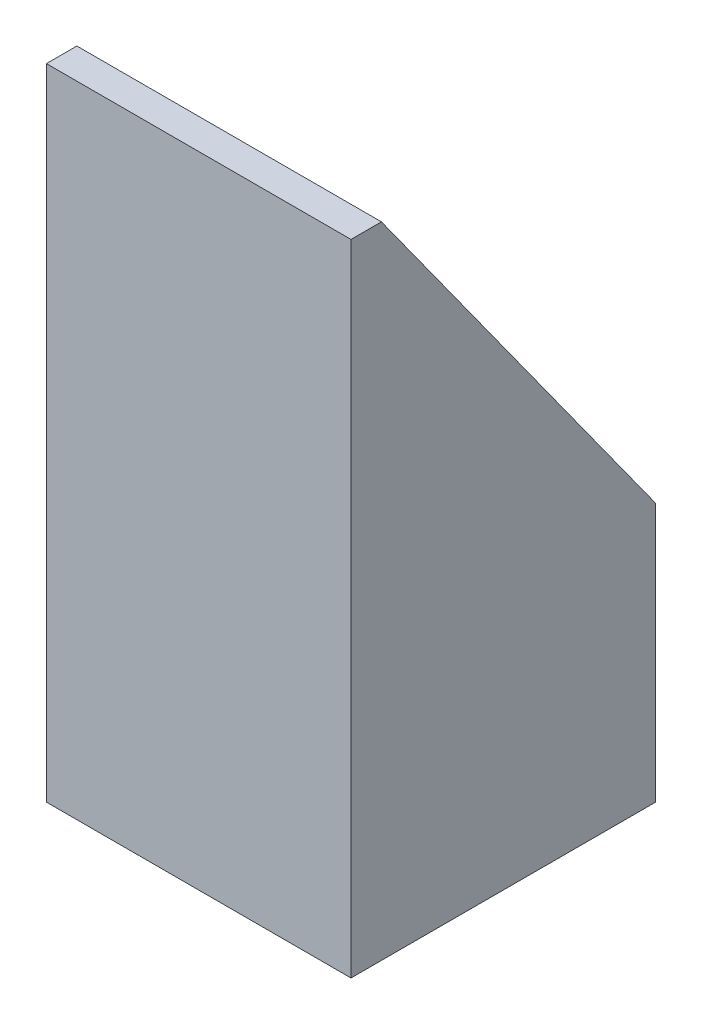
ISO-10303-21;
HEADER;
FILE_DESCRIPTION(('STEP AP214'),'2;1');
FILE_NAME('part.step','',(''),(''),'','','');
FILE_SCHEMA(('AUTOMOTIVE_DESIGN { 1 0 10303 214 1 1 1 1 }'));
ENDSEC;
DATA;
#1=APPLICATION_CONTEXT('core data for automotive mechanical design processes');
#2=APPLICATION_PROTOCOL_DEFINITION('international standard','automotive_design',2000,#1);
#3=PRODUCT_CONTEXT('',#1,'mechanical');
#4=PRODUCT('Part','Part','',(#3));
#5=PRODUCT_RELATED_PRODUCT_CATEGORY('part','',(#4));
#6=PRODUCT_DEFINITION_FORMATION('','',#4);
#7=PRODUCT_DEFINITION_CONTEXT('part definition',#1,'design');
#8=PRODUCT_DEFINITION('design','',#6,#7);
#9=PRODUCT_DEFINITION_SHAPE('','',#8);
#10=(LENGTH_UNIT() NAMED_UNIT(*) SI_UNIT(.MILLI.,.METRE.));
#11=(NAMED_UNIT(*) PLANE_ANGLE_UNIT() SI_UNIT($,.RADIAN.));
#12=(NAMED_UNIT(*) SI_UNIT($,.STERADIAN.) SOLID_ANGLE_UNIT());
#13=UNCERTAINTY_MEASURE_WITH_UNIT(LENGTH_MEASURE(1.E-05),#10,'distance_accuracy_value','');
#14=(GEOMETRIC_REPRESENTATION_CONTEXT(3) GLOBAL_UNCERTAINTY_ASSIGNED_CONTEXT((#13)) GLOBAL_UNIT_ASSIGNED_CONTEXT((#10,
#11,#12)) REPRESENTATION_CONTEXT('',''));
#15=CARTESIAN_POINT('',(0.,0.,0.));
#16=DIRECTION('',(0.,0.,1.));
#17=DIRECTION('',(1.,0.,0.));
#18=AXIS2_PLACEMENT_3D('',#15,#16,#17);
#19=CARTESIAN_POINT('',(0.,40.,0.));
#20=DIRECTION('',(0.,1.,0.));
#21=DIRECTION('',(0.,0.,1.));
#22=AXIS2_PLACEMENT_3D('',#19,#20,#21);
#23=PLANE('',#22);
#24=DIRECTION('',(1.,0.,0.));
#25=VECTOR('',#24,1.);
#26=CARTESIAN_POINT('',(0.,40.,18.));
#27=LINE('',#26,#25);
#28=CARTESIAN_POINT('',(0.,40.,18.));
#29=VERTEX_POINT('',#28);
#30=CARTESIAN_POINT('',(2.,40.,18.));
#31=VERTEX_POINT('',#30);
#32=EDGE_CURVE('E147',#29,#31,#27,.T.);
#33=ORIENTED_EDGE('',*,*,#32,.F.);
#34=DIRECTION('',(0.,0.,1.));
#35=VECTOR('',#34,1.);
#36=CARTESIAN_POINT('',(0.,40.,0.));
#37=LINE('',#36,#35);
#38=CARTESIAN_POINT('',(0.,40.,20.));
#39=VERTEX_POINT('',#38);
#40=EDGE_CURVE('E178',#29,#39,#37,.T.);
#41=ORIENTED_EDGE('',*,*,#40,.T.);
#42=DIRECTION('',(1.,0.,0.));
#43=VECTOR('',#42,1.);
#44=CARTESIAN_POINT('',(0.,40.,20.));
#45=LINE('',#44,#43);
#46=CARTESIAN_POINT('',(20.,40.,20.));
#47=VERTEX_POINT('',#46);
#48=EDGE_CURVE('E56',#39,#47,#45,.T.);
#49=ORIENTED_EDGE('',*,*,#48,.T.);
#50=DIRECTION('',(0.,0.,-1.));
#51=VECTOR('',#50,1.);
#52=CARTESIAN_POINT('',(20.,40.,0.));
#53=LINE('',#52,#51);
#54=CARTESIAN_POINT('',(20.,40.,18.));
#55=VERTEX_POINT('',#54);
#56=EDGE_CURVE('E112',#47,#55,#53,.T.);
#57=ORIENTED_EDGE('',*,*,#56,.T.);
#58=CARTESIAN_POINT('',(18.,40.,18.));
#59=VERTEX_POINT('',#58);
#60=EDGE_CURVE('E143',#59,#55,#27,.T.);
#61=ORIENTED_EDGE('',*,*,#60,.F.);
#62=DIRECTION('',(1.,0.,0.));
#63=VECTOR('',#62,1.);
#64=CARTESIAN_POINT('',(2.,40.,18.));
#65=LINE('',#64,#63);
#66=EDGE_CURVE('E155',#31,#59,#65,.T.);
#67=ORIENTED_EDGE('',*,*,#66,.F.);
#68=EDGE_LOOP('',(#33,#41,#49,#57,#61,#67));
#69=FACE_BOUND('',#68,.T.);
#70=ADVANCED_FACE('F34',(#69),#23,.T.);
#71=CARTESIAN_POINT('',(0.,40.,0.));
#72=DIRECTION('',(1.,0.,0.));
#73=DIRECTION('',(0.,0.,-1.));
#74=AXIS2_PLACEMENT_3D('',#71,#72,#73);
#75=PLANE('',#74);
#76=ORIENTED_EDGE('',*,*,#40,.F.);
#77=DIRECTION('',(0.,-0.811534341451494,-0.584304725845076));
#78=VECTOR('',#77,1.);
#79=CARTESIAN_POINT('',(0.,40.,18.));
#80=LINE('',#79,#78);
#81=CARTESIAN_POINT('',(0.,15.,0.));
#82=VERTEX_POINT('',#81);
#83=EDGE_CURVE('E140',#29,#82,#80,.T.);
#84=ORIENTED_EDGE('',*,*,#83,.T.);
#85=DIRECTION('',(0.,-1.,0.));
#86=VECTOR('',#85,1.);
#87=CARTESIAN_POINT('',(0.,40.,0.));
#88=LINE('',#87,#86);
#89=CARTESIAN_POINT('',(0.,-2.,0.));
#90=VERTEX_POINT('',#89);
#91=EDGE_CURVE('E182',#82,#90,#88,.T.);
#92=ORIENTED_EDGE('',*,*,#91,.T.);
#93=DIRECTION('',(0.,0.,-1.));
#94=VECTOR('',#93,1.);
#95=CARTESIAN_POINT('',(0.,-2.,20.));
#96=LINE('',#95,#94);
#97=CARTESIAN_POINT('',(0.,-2.,20.));
#98=VERTEX_POINT('',#97);
#99=EDGE_CURVE('E123',#98,#90,#96,.T.);
#100=ORIENTED_EDGE('',*,*,#99,.F.);
#101=DIRECTION('',(0.,-1.,0.));
#102=VECTOR('',#101,1.);
#103=CARTESIAN_POINT('',(0.,40.,20.));
#104=LINE('',#103,#102);
#105=EDGE_CURVE('E42',#39,#98,#104,.T.);
#106=ORIENTED_EDGE('',*,*,#105,.F.);
#107=EDGE_LOOP('',(#76,#84,#92,#100,#106));
#108=FACE_BOUND('',#107,.T.);
#109=ADVANCED_FACE('F36',(#108),#75,.F.);
#110=CARTESIAN_POINT('',(0.,40.,20.));
#111=DIRECTION('',(0.,0.,-1.));
#112=DIRECTION('',(-1.,0.,0.));
#113=AXIS2_PLACEMENT_3D('',#110,#111,#112);
#114=PLANE('',#113);
#115=ORIENTED_EDGE('',*,*,#105,.T.);
#116=DIRECTION('',(-1.,0.,0.));
#117=VECTOR('',#116,1.);
#118=CARTESIAN_POINT('',(20.,-2.,20.));
#119=LINE('',#118,#117);
#120=CARTESIAN_POINT('',(20.,-2.,20.));
#121=VERTEX_POINT('',#120);
#122=EDGE_CURVE('E117',#121,#98,#119,.T.);
#123=ORIENTED_EDGE('',*,*,#122,.F.);
#124=DIRECTION('',(0.,-1.,0.));
#125=VECTOR('',#124,1.);
#126=CARTESIAN_POINT('',(20.,40.,20.));
#127=LINE('',#126,#125);
#128=EDGE_CURVE('E105',#47,#121,#127,.T.);
#129=ORIENTED_EDGE('',*,*,#128,.F.);
#130=ORIENTED_EDGE('',*,*,#48,.F.);
#131=EDGE_LOOP('',(#115,#123,#129,#130));
#132=FACE_BOUND('',#131,.T.);
#133=ADVANCED_FACE('F118',(#132),#114,.F.);
#134=CARTESIAN_POINT('',(20.,40.,0.));
#135=DIRECTION('',(-1.,0.,0.));
#136=DIRECTION('',(0.,0.,1.));
#137=AXIS2_PLACEMENT_3D('',#134,#135,#136);
#138=PLANE('',#137);
#139=DIRECTION('',(0.,-1.,0.));
#140=VECTOR('',#139,1.);
#141=CARTESIAN_POINT('',(20.,40.,0.));
#142=LINE('',#141,#140);
#143=CARTESIAN_POINT('',(20.,15.,0.));
#144=VERTEX_POINT('',#143);
#145=CARTESIAN_POINT('',(20.,-2.,0.));
#146=VERTEX_POINT('',#145);
#147=EDGE_CURVE('E114',#144,#146,#142,.T.);
#148=ORIENTED_EDGE('',*,*,#147,.F.);
#149=DIRECTION('',(0.,0.811534341451494,0.584304725845076));
#150=VECTOR('',#149,1.);
#151=CARTESIAN_POINT('',(20.,31.4646996838778,11.854583772392));
#152=LINE('',#151,#150);
#153=EDGE_CURVE('E152',#144,#55,#152,.T.);
#154=ORIENTED_EDGE('',*,*,#153,.T.);
#155=ORIENTED_EDGE('',*,*,#56,.F.);
#156=ORIENTED_EDGE('',*,*,#128,.T.);
#157=DIRECTION('',(0.,0.,1.));
#158=VECTOR('',#157,1.);
#159=CARTESIAN_POINT('',(20.,-2.,20.));
#160=LINE('',#159,#158);
#161=EDGE_CURVE('E110',#146,#121,#160,.T.);
#162=ORIENTED_EDGE('',*,*,#161,.F.);
#163=EDGE_LOOP('',(#148,#154,#155,#156,#162));
#164=FACE_BOUND('',#163,.T.);
#165=ADVANCED_FACE('F108',(#164),#138,.F.);
#166=CARTESIAN_POINT('',(0.,40.,0.));
#167=DIRECTION('',(0.,0.,1.));
#168=DIRECTION('',(1.,0.,0.));
#169=AXIS2_PLACEMENT_3D('',#166,#167,#168);
#170=PLANE('',#169);
#171=ORIENTED_EDGE('',*,*,#91,.F.);
#172=DIRECTION('',(1.,0.,0.));
#173=VECTOR('',#172,1.);
#174=CARTESIAN_POINT('',(0.,15.,0.));
#175=LINE('',#174,#173);
#176=EDGE_CURVE('E144',#82,#144,#175,.T.);
#177=ORIENTED_EDGE('',*,*,#176,.T.);
#178=ORIENTED_EDGE('',*,*,#147,.T.);
#179=DIRECTION('',(1.,0.,0.));
#180=VECTOR('',#179,1.);
#181=CARTESIAN_POINT('',(20.,-2.,0.));
#182=LINE('',#181,#180);
#183=EDGE_CURVE('E128',#90,#146,#182,.T.);
#184=ORIENTED_EDGE('',*,*,#183,.F.);
#185=EDGE_LOOP('',(#171,#177,#178,#184));
#186=FACE_BOUND('',#185,.T.);
#187=ADVANCED_FACE('F186',(#186),#170,.F.);
#188=CARTESIAN_POINT('',(2.,40.,2.));
#189=DIRECTION('',(0.,0.,1.));
#190=DIRECTION('',(1.,0.,0.));
#191=AXIS2_PLACEMENT_3D('',#188,#189,#190);
#192=PLANE('',#191);
#193=DIRECTION('',(1.,0.,0.));
#194=VECTOR('',#193,1.);
#195=CARTESIAN_POINT('',(2.00000000000001,17.7777777777778,2.));
#196=LINE('',#195,#194);
#197=CARTESIAN_POINT('',(2.,17.7777777777778,2.));
#198=VERTEX_POINT('',#197);
#199=CARTESIAN_POINT('',(18.,17.7777777777778,2.));
#200=VERTEX_POINT('',#199);
#201=EDGE_CURVE('E48',#198,#200,#196,.T.);
#202=ORIENTED_EDGE('',*,*,#201,.F.);
#203=DIRECTION('',(0.,-1.,0.));
#204=VECTOR('',#203,1.);
#205=CARTESIAN_POINT('',(2.,40.,2.));
#206=LINE('',#205,#204);
#207=CARTESIAN_POINT('',(2.,0.,2.));
#208=VERTEX_POINT('',#207);
#209=EDGE_CURVE('E176',#198,#208,#206,.T.);
#210=ORIENTED_EDGE('',*,*,#209,.T.);
#211=DIRECTION('',(-1.,0.,0.));
#212=VECTOR('',#211,1.);
#213=CARTESIAN_POINT('',(2.,0.,2.));
#214=LINE('',#213,#212);
#215=CARTESIAN_POINT('',(18.,0.,2.));
#216=VERTEX_POINT('',#215);
#217=EDGE_CURVE('E154',#216,#208,#214,.T.);
#218=ORIENTED_EDGE('',*,*,#217,.F.);
#219=DIRECTION('',(0.,-1.,0.));
#220=VECTOR('',#219,1.);
#221=CARTESIAN_POINT('',(18.,40.,2.));
#222=LINE('',#221,#220);
#223=EDGE_CURVE('E158',#200,#216,#222,.T.);
#224=ORIENTED_EDGE('',*,*,#223,.F.);
#225=EDGE_LOOP('',(#202,#210,#218,#224));
#226=FACE_BOUND('',#225,.T.);
#227=ADVANCED_FACE('F206',(#226),#192,.T.);
#228=CARTESIAN_POINT('',(2.,40.,2.));
#229=DIRECTION('',(1.,0.,0.));
#230=DIRECTION('',(0.,0.,-1.));
#231=AXIS2_PLACEMENT_3D('',#228,#229,#230);
#232=PLANE('',#231);
#233=DIRECTION('',(0.,-0.811534341451494,-0.584304725845076));
#234=VECTOR('',#233,1.);
#235=CARTESIAN_POINT('',(2.,32.4130663856691,12.5374077976818));
#236=LINE('',#235,#234);
#237=EDGE_CURVE('E150',#31,#198,#236,.T.);
#238=ORIENTED_EDGE('',*,*,#237,.F.);
#239=DIRECTION('',(0.,-1.,0.));
#240=VECTOR('',#239,1.);
#241=CARTESIAN_POINT('',(2.,40.,18.));
#242=LINE('',#241,#240);
#243=CARTESIAN_POINT('',(2.,0.,18.));
#244=VERTEX_POINT('',#243);
#245=EDGE_CURVE('E174',#31,#244,#242,.T.);
#246=ORIENTED_EDGE('',*,*,#245,.T.);
#247=DIRECTION('',(0.,0.,1.));
#248=VECTOR('',#247,1.);
#249=CARTESIAN_POINT('',(2.,0.,2.));
#250=LINE('',#249,#248);
#251=EDGE_CURVE('E162',#208,#244,#250,.T.);
#252=ORIENTED_EDGE('',*,*,#251,.F.);
#253=ORIENTED_EDGE('',*,*,#209,.F.);
#254=EDGE_LOOP('',(#238,#246,#252,#253));
#255=FACE_BOUND('',#254,.T.);
#256=ADVANCED_FACE('F202',(#255),#232,.T.);
#257=CARTESIAN_POINT('',(2.,40.,18.));
#258=DIRECTION('',(0.,0.,-1.));
#259=DIRECTION('',(-1.,0.,0.));
#260=AXIS2_PLACEMENT_3D('',#257,#258,#259);
#261=PLANE('',#260);
#262=DIRECTION('',(1.,0.,0.));
#263=VECTOR('',#262,1.);
#264=CARTESIAN_POINT('',(2.,0.,18.));
#265=LINE('',#264,#263);
#266=CARTESIAN_POINT('',(18.,0.,18.));
#267=VERTEX_POINT('',#266);
#268=EDGE_CURVE('E165',#244,#267,#265,.T.);
#269=ORIENTED_EDGE('',*,*,#268,.F.);
#270=ORIENTED_EDGE('',*,*,#245,.F.);
#271=ORIENTED_EDGE('',*,*,#66,.T.);
#272=DIRECTION('',(0.,-1.,0.));
#273=VECTOR('',#272,1.);
#274=CARTESIAN_POINT('',(18.,40.,18.));
#275=LINE('',#274,#273);
#276=EDGE_CURVE('E172',#59,#267,#275,.T.);
#277=ORIENTED_EDGE('',*,*,#276,.T.);
#278=EDGE_LOOP('',(#269,#270,#271,#277));
#279=FACE_BOUND('',#278,.T.);
#280=ADVANCED_FACE('F198',(#279),#261,.T.);
#281=CARTESIAN_POINT('',(18.,40.,2.));
#282=DIRECTION('',(-1.,0.,0.));
#283=DIRECTION('',(0.,0.,1.));
#284=AXIS2_PLACEMENT_3D('',#281,#282,#283);
#285=PLANE('',#284);
#286=DIRECTION('',(0.,0.811534341451494,0.584304725845076));
#287=VECTOR('',#286,1.);
#288=CARTESIAN_POINT('',(18.,32.4130663856691,12.5374077976818));
#289=LINE('',#288,#287);
#290=EDGE_CURVE('E11',#200,#59,#289,.T.);
#291=ORIENTED_EDGE('',*,*,#290,.F.);
#292=ORIENTED_EDGE('',*,*,#223,.T.);
#293=DIRECTION('',(0.,0.,-1.));
#294=VECTOR('',#293,1.);
#295=CARTESIAN_POINT('',(18.,0.,2.));
#296=LINE('',#295,#294);
#297=EDGE_CURVE('E159',#267,#216,#296,.T.);
#298=ORIENTED_EDGE('',*,*,#297,.F.);
#299=ORIENTED_EDGE('',*,*,#276,.F.);
#300=EDGE_LOOP('',(#291,#292,#298,#299));
#301=FACE_BOUND('',#300,.T.);
#302=ADVANCED_FACE('F193',(#301),#285,.T.);
#303=CARTESIAN_POINT('',(0.,40.,18.));
#304=DIRECTION('',(0.,-0.584304725845076,0.811534341451494));
#305=DIRECTION('',(0.,-0.811534341451494,-0.584304725845076));
#306=AXIS2_PLACEMENT_3D('',#303,#304,#305);
#307=PLANE('',#306);
#308=ORIENTED_EDGE('',*,*,#176,.F.);
#309=ORIENTED_EDGE('',*,*,#83,.F.);
#310=ORIENTED_EDGE('',*,*,#32,.T.);
#311=ORIENTED_EDGE('',*,*,#237,.T.);
#312=ORIENTED_EDGE('',*,*,#201,.T.);
#313=ORIENTED_EDGE('',*,*,#290,.T.);
#314=ORIENTED_EDGE('',*,*,#60,.T.);
#315=ORIENTED_EDGE('',*,*,#153,.F.);
#316=EDGE_LOOP('',(#308,#309,#310,#311,#312,#313,#314,#315));
#317=FACE_BOUND('',#316,.T.);
#318=ADVANCED_FACE('F204',(#317),#307,.F.);
#319=CARTESIAN_POINT('',(0.,0.,0.));
#320=DIRECTION('',(0.,1.,0.));
#321=DIRECTION('',(0.,0.,1.));
#322=AXIS2_PLACEMENT_3D('',#319,#320,#321);
#323=PLANE('',#322);
#324=CARTESIAN_POINT('',(10.,0.,14.));
#325=DIRECTION('',(0.,-1.,0.));
#326=DIRECTION('',(0.,0.,-1.));
#327=AXIS2_PLACEMENT_3D('',#324,#325,#326);
#328=CIRCLE('',#327,2.);
#329=CARTESIAN_POINT('',(10.,0.,12.));
#330=VERTEX_POINT('',#329);
#331=EDGE_CURVE('E129',#330,#330,#328,.T.);
#332=ORIENTED_EDGE('',*,*,#331,.T.);
#333=EDGE_LOOP('',(#332));
#334=FACE_BOUND('',#333,.T.);
#335=CARTESIAN_POINT('',(10.,0.,6.));
#336=DIRECTION('',(0.,-1.,0.));
#337=DIRECTION('',(0.,0.,-1.));
#338=AXIS2_PLACEMENT_3D('',#335,#336,#337);
#339=CIRCLE('',#338,2.);
#340=CARTESIAN_POINT('',(10.,0.,4.));
#341=VERTEX_POINT('',#340);
#342=EDGE_CURVE('E333',#341,#341,#339,.T.);
#343=ORIENTED_EDGE('',*,*,#342,.T.);
#344=EDGE_LOOP('',(#343));
#345=FACE_BOUND('',#344,.T.);
#346=ORIENTED_EDGE('',*,*,#297,.T.);
#347=ORIENTED_EDGE('',*,*,#217,.T.);
#348=ORIENTED_EDGE('',*,*,#251,.T.);
#349=ORIENTED_EDGE('',*,*,#268,.T.);
#350=EDGE_LOOP('',(#346,#347,#348,#349));
#351=FACE_BOUND('',#350,.T.);
#352=ADVANCED_FACE('F208',(#334,#345,#351),#323,.T.);
#353=CARTESIAN_POINT('',(0.,-2.,0.));
#354=DIRECTION('',(0.,1.,0.));
#355=DIRECTION('',(0.,0.,1.));
#356=AXIS2_PLACEMENT_3D('',#353,#354,#355);
#357=PLANE('',#356);
#358=CARTESIAN_POINT('',(10.,-2.,14.));
#359=DIRECTION('',(0.,-1.,0.));
#360=DIRECTION('',(0.,0.,-1.));
#361=AXIS2_PLACEMENT_3D('',#358,#359,#360);
#362=CIRCLE('',#361,2.);
#363=CARTESIAN_POINT('',(10.,-2.,12.));
#364=VERTEX_POINT('',#363);
#365=EDGE_CURVE('E132',#364,#364,#362,.T.);
#366=ORIENTED_EDGE('',*,*,#365,.F.);
#367=EDGE_LOOP('',(#366));
#368=FACE_BOUND('',#367,.T.);
#369=CARTESIAN_POINT('',(10.,-2.,6.));
#370=DIRECTION('',(0.,-1.,0.));
#371=DIRECTION('',(0.,0.,-1.));
#372=AXIS2_PLACEMENT_3D('',#369,#370,#371);
#373=CIRCLE('',#372,2.);
#374=CARTESIAN_POINT('',(10.,-2.,4.));
#375=VERTEX_POINT('',#374);
#376=EDGE_CURVE('E135',#375,#375,#373,.T.);
#377=ORIENTED_EDGE('',*,*,#376,.F.);
#378=EDGE_LOOP('',(#377));
#379=FACE_BOUND('',#378,.T.);
#380=ORIENTED_EDGE('',*,*,#161,.T.);
#381=ORIENTED_EDGE('',*,*,#122,.T.);
#382=ORIENTED_EDGE('',*,*,#99,.T.);
#383=ORIENTED_EDGE('',*,*,#183,.T.);
#384=EDGE_LOOP('',(#380,#381,#382,#383));
#385=FACE_BOUND('',#384,.T.);
#386=ADVANCED_FACE('F126',(#368,#379,#385),#357,.F.);
#387=CARTESIAN_POINT('',(10.,0.,6.));
#388=DIRECTION('',(0.,-1.,0.));
#389=DIRECTION('',(0.,0.,-1.));
#390=AXIS2_PLACEMENT_3D('',#387,#388,#389);
#391=CYLINDRICAL_SURFACE('',#390,2.);
#392=ORIENTED_EDGE('',*,*,#342,.F.);
#393=EDGE_LOOP('',(#392));
#394=FACE_BOUND('',#393,.T.);
#395=ORIENTED_EDGE('',*,*,#376,.T.);
#396=EDGE_LOOP('',(#395));
#397=FACE_BOUND('',#396,.T.);
#398=ADVANCED_FACE('F216',(#394,#397),#391,.F.);
#399=CARTESIAN_POINT('',(10.,0.,14.));
#400=DIRECTION('',(0.,-1.,0.));
#401=DIRECTION('',(0.,0.,-1.));
#402=AXIS2_PLACEMENT_3D('',#399,#400,#401);
#403=CYLINDRICAL_SURFACE('',#402,2.);
#404=ORIENTED_EDGE('',*,*,#331,.F.);
#405=EDGE_LOOP('',(#404));
#406=FACE_BOUND('',#405,.T.);
#407=ORIENTED_EDGE('',*,*,#365,.T.);
#408=EDGE_LOOP('',(#407));
#409=FACE_BOUND('',#408,.T.);
#410=ADVANCED_FACE('F315',(#406,#409),#403,.F.);
#411=CLOSED_SHELL('',(#70,#109,#133,#165,#187,#227,#256,#280,#302,#318,#352,#386,#398,#410));
#412=MANIFOLD_SOLID_BREP('B2',#411);
#413=ADVANCED_BREP_SHAPE_REPRESENTATION('',(#18,#412),#14);
#414=SHAPE_DEFINITION_REPRESENTATION(#9,#413);
ENDSEC;
END-ISO-10303-21;
